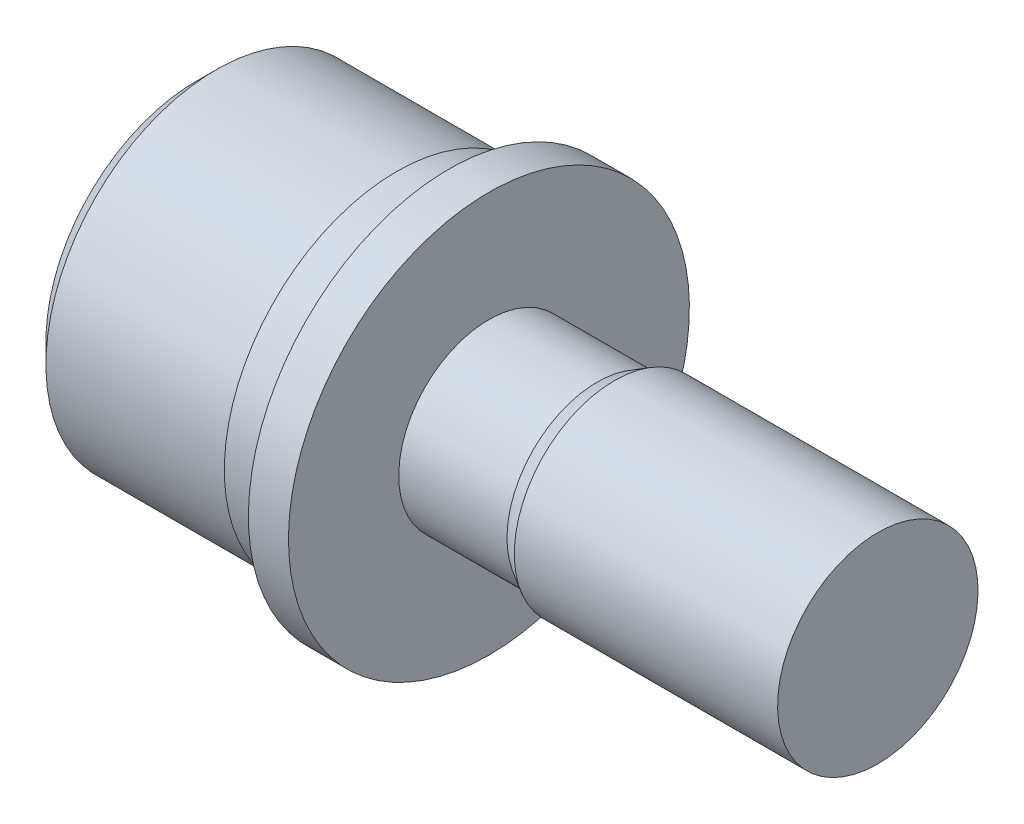
ISO-10303-21;
HEADER;
FILE_DESCRIPTION(('STEP AP214'),'2;1');
FILE_NAME('part.step','',(''),(''),'','','');
FILE_SCHEMA(('AUTOMOTIVE_DESIGN { 1 0 10303 214 1 1 1 1 }'));
ENDSEC;
DATA;
#1=APPLICATION_CONTEXT('core data for automotive mechanical design processes');
#2=APPLICATION_PROTOCOL_DEFINITION('international standard','automotive_design',2000,#1);
#3=PRODUCT_CONTEXT('',#1,'mechanical');
#4=PRODUCT('Part','Part','',(#3));
#5=PRODUCT_RELATED_PRODUCT_CATEGORY('part','',(#4));
#6=PRODUCT_DEFINITION_FORMATION('','',#4);
#7=PRODUCT_DEFINITION_CONTEXT('part definition',#1,'design');
#8=PRODUCT_DEFINITION('design','',#6,#7);
#9=PRODUCT_DEFINITION_SHAPE('','',#8);
#10=(LENGTH_UNIT() NAMED_UNIT(*) SI_UNIT(.MILLI.,.METRE.));
#11=(NAMED_UNIT(*) PLANE_ANGLE_UNIT() SI_UNIT($,.RADIAN.));
#12=(NAMED_UNIT(*) SI_UNIT($,.STERADIAN.) SOLID_ANGLE_UNIT());
#13=UNCERTAINTY_MEASURE_WITH_UNIT(LENGTH_MEASURE(1.E-05),#10,'distance_accuracy_value','');
#14=(GEOMETRIC_REPRESENTATION_CONTEXT(3) GLOBAL_UNCERTAINTY_ASSIGNED_CONTEXT((#13)) GLOBAL_UNIT_ASSIGNED_CONTEXT((#10,
#11,#12)) REPRESENTATION_CONTEXT('',''));
#15=CARTESIAN_POINT('',(0.,0.,0.));
#16=DIRECTION('',(0.,0.,1.));
#17=DIRECTION('',(1.,0.,0.));
#18=AXIS2_PLACEMENT_3D('',#15,#16,#17);
#19=CARTESIAN_POINT('',(-4.8,0.,0.));
#20=DIRECTION('',(-1.,0.,0.));
#21=DIRECTION('',(0.,0.,1.));
#22=AXIS2_PLACEMENT_3D('',#19,#20,#21);
#23=PLANE('',#22);
#24=DIRECTION('',(0.,-0.5,-0.866025403784439));
#25=VECTOR('',#24,1.);
#26=CARTESIAN_POINT('',(-4.8,1.73205080756888,-0.999999999999999));
#27=LINE('',#26,#25);
#28=CARTESIAN_POINT('',(-4.79999999999996,1.73205080756897,-1.00000000000005));
#29=VERTEX_POINT('',#28);
#30=CARTESIAN_POINT('',(-4.8,1.15470053837925,-2.));
#31=VERTEX_POINT('',#30);
#32=EDGE_CURVE('E90',#29,#31,#27,.T.);
#33=ORIENTED_EDGE('',*,*,#32,.T.);
#34=DIRECTION('',(0.,1.,0.));
#35=VECTOR('',#34,1.);
#36=CARTESIAN_POINT('',(-4.8,0.,-2.));
#37=LINE('',#36,#35);
#38=CARTESIAN_POINT('',(-4.79999999999996,0.,-2.00000000000011));
#39=VERTEX_POINT('',#38);
#40=EDGE_CURVE('E87',#31,#39,#37,.F.);
#41=ORIENTED_EDGE('',*,*,#40,.T.);
#42=CARTESIAN_POINT('',(-4.79999999999992,0.,0.));
#43=DIRECTION('',(-1.,0.,0.));
#44=DIRECTION('',(0.,0.,1.));
#45=AXIS2_PLACEMENT_3D('',#42,#43,#44);
#46=CIRCLE('',#45,2.00000000000022);
#47=EDGE_CURVE('E18',#39,#29,#46,.F.);
#48=ORIENTED_EDGE('',*,*,#47,.T.);
#49=EDGE_LOOP('',(#33,#41,#48));
#50=FACE_BOUND('',#49,.T.);
#51=ADVANCED_FACE('F15',(#50),#23,.T.);
#52=CARTESIAN_POINT('',(-4.8,0.,0.));
#53=DIRECTION('',(-1.,0.,0.));
#54=DIRECTION('',(0.,0.,1.));
#55=AXIS2_PLACEMENT_3D('',#52,#53,#54);
#56=PLANE('',#55);
#57=DIRECTION('',(0.,0.499999999999998,-0.86602540378444));
#58=VECTOR('',#57,1.);
#59=CARTESIAN_POINT('',(-4.8,1.73205080756888,0.999999999999999));
#60=LINE('',#59,#58);
#61=CARTESIAN_POINT('',(-4.79999999999996,1.73205080756897,1.00000000000006));
#62=VERTEX_POINT('',#61);
#63=CARTESIAN_POINT('',(-4.8,2.3094010767585,0.));
#64=VERTEX_POINT('',#63);
#65=EDGE_CURVE('E95',#62,#64,#60,.T.);
#66=ORIENTED_EDGE('',*,*,#65,.T.);
#67=DIRECTION('',(0.,-0.499999999999999,-0.866025403784439));
#68=VECTOR('',#67,1.);
#69=CARTESIAN_POINT('',(-4.8,2.3094010767585,0.));
#70=LINE('',#69,#68);
#71=EDGE_CURVE('E137',#64,#29,#70,.T.);
#72=ORIENTED_EDGE('',*,*,#71,.T.);
#73=CARTESIAN_POINT('',(-4.79999999999992,0.,0.));
#74=DIRECTION('',(-1.,0.,0.));
#75=DIRECTION('',(0.,0.,1.));
#76=AXIS2_PLACEMENT_3D('',#73,#74,#75);
#77=CIRCLE('',#76,2.00000000000022);
#78=EDGE_CURVE('E106',#29,#62,#77,.F.);
#79=ORIENTED_EDGE('',*,*,#78,.T.);
#80=EDGE_LOOP('',(#66,#72,#79));
#81=FACE_BOUND('',#80,.T.);
#82=ADVANCED_FACE('F186',(#81),#56,.T.);
#83=CARTESIAN_POINT('',(-4.8,0.,0.));
#84=DIRECTION('',(-1.,0.,0.));
#85=DIRECTION('',(0.,0.,1.));
#86=AXIS2_PLACEMENT_3D('',#83,#84,#85);
#87=PLANE('',#86);
#88=DIRECTION('',(0.,1.,0.));
#89=VECTOR('',#88,1.);
#90=CARTESIAN_POINT('',(-4.8,0.,2.));
#91=LINE('',#90,#89);
#92=CARTESIAN_POINT('',(-4.79999999999996,0.,2.00000000000011));
#93=VERTEX_POINT('',#92);
#94=CARTESIAN_POINT('',(-4.8,1.15470053837925,2.));
#95=VERTEX_POINT('',#94);
#96=EDGE_CURVE('E135',#93,#95,#91,.T.);
#97=ORIENTED_EDGE('',*,*,#96,.T.);
#98=DIRECTION('',(0.,0.500000000000001,-0.866025403784438));
#99=VECTOR('',#98,1.);
#100=CARTESIAN_POINT('',(-4.8,1.15470053837925,2.));
#101=LINE('',#100,#99);
#102=EDGE_CURVE('E133',#95,#62,#101,.T.);
#103=ORIENTED_EDGE('',*,*,#102,.T.);
#104=CARTESIAN_POINT('',(-4.79999999999992,0.,0.));
#105=DIRECTION('',(-1.,0.,0.));
#106=DIRECTION('',(0.,0.,1.));
#107=AXIS2_PLACEMENT_3D('',#104,#105,#106);
#108=CIRCLE('',#107,2.00000000000022);
#109=EDGE_CURVE('E183',#62,#93,#108,.F.);
#110=ORIENTED_EDGE('',*,*,#109,.T.);
#111=EDGE_LOOP('',(#97,#103,#110));
#112=FACE_BOUND('',#111,.T.);
#113=ADVANCED_FACE('F427',(#112),#87,.T.);
#114=CARTESIAN_POINT('',(-4.8,0.,0.));
#115=DIRECTION('',(-1.,0.,0.));
#116=DIRECTION('',(0.,0.,1.));
#117=AXIS2_PLACEMENT_3D('',#114,#115,#116);
#118=PLANE('',#117);
#119=DIRECTION('',(0.,0.499999999999999,0.866025403784439));
#120=VECTOR('',#119,1.);
#121=CARTESIAN_POINT('',(-4.8,-1.73205080756888,0.999999999999999));
#122=LINE('',#121,#120);
#123=CARTESIAN_POINT('',(-4.79999999999996,-1.73205080756897,1.00000000000006));
#124=VERTEX_POINT('',#123);
#125=CARTESIAN_POINT('',(-4.8,-1.15470053837925,2.));
#126=VERTEX_POINT('',#125);
#127=EDGE_CURVE('E131',#124,#126,#122,.T.);
#128=ORIENTED_EDGE('',*,*,#127,.T.);
#129=DIRECTION('',(0.,1.,0.));
#130=VECTOR('',#129,1.);
#131=CARTESIAN_POINT('',(-4.8,0.,2.));
#132=LINE('',#131,#130);
#133=EDGE_CURVE('E129',#126,#93,#132,.T.);
#134=ORIENTED_EDGE('',*,*,#133,.T.);
#135=CARTESIAN_POINT('',(-4.79999999999992,0.,0.));
#136=DIRECTION('',(-1.,0.,0.));
#137=DIRECTION('',(0.,0.,1.));
#138=AXIS2_PLACEMENT_3D('',#135,#136,#137);
#139=CIRCLE('',#138,2.00000000000022);
#140=EDGE_CURVE('E180',#93,#124,#139,.F.);
#141=ORIENTED_EDGE('',*,*,#140,.T.);
#142=EDGE_LOOP('',(#128,#134,#141));
#143=FACE_BOUND('',#142,.T.);
#144=ADVANCED_FACE('F417',(#143),#118,.T.);
#145=CARTESIAN_POINT('',(-4.8,0.,0.));
#146=DIRECTION('',(-1.,0.,0.));
#147=DIRECTION('',(0.,0.,1.));
#148=AXIS2_PLACEMENT_3D('',#145,#146,#147);
#149=PLANE('',#148);
#150=DIRECTION('',(0.,-0.5,0.866025403784438));
#151=VECTOR('',#150,1.);
#152=CARTESIAN_POINT('',(-4.8,-1.73205080756888,-1.));
#153=LINE('',#152,#151);
#154=CARTESIAN_POINT('',(-4.79999999999996,-1.73205080756897,-1.00000000000006));
#155=VERTEX_POINT('',#154);
#156=CARTESIAN_POINT('',(-4.8,-2.3094010767585,0.));
#157=VERTEX_POINT('',#156);
#158=EDGE_CURVE('E127',#155,#157,#153,.T.);
#159=ORIENTED_EDGE('',*,*,#158,.T.);
#160=DIRECTION('',(0.,0.500000000000001,0.866025403784438));
#161=VECTOR('',#160,1.);
#162=CARTESIAN_POINT('',(-4.8,-2.3094010767585,0.));
#163=LINE('',#162,#161);
#164=EDGE_CURVE('E107',#157,#124,#163,.T.);
#165=ORIENTED_EDGE('',*,*,#164,.T.);
#166=CARTESIAN_POINT('',(-4.79999999999992,0.,0.));
#167=DIRECTION('',(-1.,0.,0.));
#168=DIRECTION('',(0.,0.,1.));
#169=AXIS2_PLACEMENT_3D('',#166,#167,#168);
#170=CIRCLE('',#169,2.00000000000022);
#171=EDGE_CURVE('E115',#124,#155,#170,.F.);
#172=ORIENTED_EDGE('',*,*,#171,.T.);
#173=EDGE_LOOP('',(#159,#165,#172));
#174=FACE_BOUND('',#173,.T.);
#175=ADVANCED_FACE('F407',(#174),#149,.T.);
#176=CARTESIAN_POINT('',(-4.79999999999992,0.,0.));
#177=DIRECTION('',(-1.,0.,0.));
#178=DIRECTION('',(0.,0.,1.));
#179=AXIS2_PLACEMENT_3D('',#176,#177,#178);
#180=CONICAL_SURFACE('',#179,2.00000000000022,1.04719755119659);
#181=CARTESIAN_POINT('',(-3.64529946162073,0.,-2.22044604925031E-13));
#182=VERTEX_POINT('',#181);
#183=VERTEX_LOOP('',#182);
#184=FACE_BOUND('',#183,.T.);
#185=ORIENTED_EDGE('',*,*,#47,.F.);
#186=CARTESIAN_POINT('',(-4.79999999999992,0.,0.));
#187=DIRECTION('',(-1.,0.,0.));
#188=DIRECTION('',(0.,0.,1.));
#189=AXIS2_PLACEMENT_3D('',#186,#187,#188);
#190=CIRCLE('',#189,2.00000000000022);
#191=EDGE_CURVE('E103',#155,#39,#190,.F.);
#192=ORIENTED_EDGE('',*,*,#191,.F.);
#193=ORIENTED_EDGE('',*,*,#171,.F.);
#194=ORIENTED_EDGE('',*,*,#140,.F.);
#195=ORIENTED_EDGE('',*,*,#109,.F.);
#196=ORIENTED_EDGE('',*,*,#78,.F.);
#197=EDGE_LOOP('',(#185,#192,#193,#194,#195,#196));
#198=FACE_BOUND('',#197,.T.);
#199=ADVANCED_FACE('F101',(#184,#198),#180,.F.);
#200=CARTESIAN_POINT('',(-4.8,0.,0.));
#201=DIRECTION('',(-1.,0.,0.));
#202=DIRECTION('',(0.,0.,1.));
#203=AXIS2_PLACEMENT_3D('',#200,#201,#202);
#204=PLANE('',#203);
#205=DIRECTION('',(0.,1.,0.));
#206=VECTOR('',#205,1.);
#207=CARTESIAN_POINT('',(-4.8,1.15470053837925,-2.));
#208=LINE('',#207,#206);
#209=CARTESIAN_POINT('',(-4.8,-1.15470053837925,-2.));
#210=VERTEX_POINT('',#209);
#211=EDGE_CURVE('E112',#39,#210,#208,.F.);
#212=ORIENTED_EDGE('',*,*,#211,.T.);
#213=DIRECTION('',(0.,-0.5,0.866025403784439));
#214=VECTOR('',#213,1.);
#215=CARTESIAN_POINT('',(-4.8,-1.15470053837925,-2.));
#216=LINE('',#215,#214);
#217=EDGE_CURVE('E114',#210,#155,#216,.T.);
#218=ORIENTED_EDGE('',*,*,#217,.T.);
#219=ORIENTED_EDGE('',*,*,#191,.T.);
#220=EDGE_LOOP('',(#212,#218,#219));
#221=FACE_BOUND('',#220,.T.);
#222=ADVANCED_FACE('F111',(#221),#204,.T.);
#223=CARTESIAN_POINT('',(-4.8,1.15470053837925,-2.));
#224=DIRECTION('',(0.,0.,-1.));
#225=DIRECTION('',(0.,1.,0.));
#226=AXIS2_PLACEMENT_3D('',#223,#224,#225);
#227=PLANE('',#226);
#228=DIRECTION('',(1.,0.,0.));
#229=VECTOR('',#228,1.);
#230=CARTESIAN_POINT('',(-4.8,-1.15470053837925,-2.));
#231=LINE('',#230,#229);
#232=CARTESIAN_POINT('',(-7.3,-1.15470053837925,-2.));
#233=VERTEX_POINT('',#232);
#234=EDGE_CURVE('E119',#233,#210,#231,.T.);
#235=ORIENTED_EDGE('',*,*,#234,.T.);
#236=ORIENTED_EDGE('',*,*,#211,.F.);
#237=ORIENTED_EDGE('',*,*,#40,.F.);
#238=DIRECTION('',(1.,0.,0.));
#239=VECTOR('',#238,1.);
#240=CARTESIAN_POINT('',(-4.8,1.15470053837925,-2.));
#241=LINE('',#240,#239);
#242=CARTESIAN_POINT('',(-7.3,1.15470053837925,-2.));
#243=VERTEX_POINT('',#242);
#244=EDGE_CURVE('E151',#31,#243,#241,.F.);
#245=ORIENTED_EDGE('',*,*,#244,.T.);
#246=DIRECTION('',(0.,1.,0.));
#247=VECTOR('',#246,1.);
#248=CARTESIAN_POINT('',(-7.3,4.25,-2.));
#249=LINE('',#248,#247);
#250=EDGE_CURVE('E152',#243,#233,#249,.F.);
#251=ORIENTED_EDGE('',*,*,#250,.T.);
#252=EDGE_LOOP('',(#235,#236,#237,#245,#251));
#253=FACE_BOUND('',#252,.T.);
#254=ADVANCED_FACE('F117',(#253),#227,.F.);
#255=CARTESIAN_POINT('',(-4.8,-1.15470053837925,-2.));
#256=DIRECTION('',(0.,-0.866025403784439,-0.5));
#257=DIRECTION('',(0.,0.5,-0.866025403784439));
#258=AXIS2_PLACEMENT_3D('',#255,#256,#257);
#259=PLANE('',#258);
#260=DIRECTION('',(1.,0.,0.));
#261=VECTOR('',#260,1.);
#262=CARTESIAN_POINT('',(-4.8,-2.3094010767585,0.));
#263=LINE('',#262,#261);
#264=CARTESIAN_POINT('',(-7.3,-2.3094010767585,0.));
#265=VERTEX_POINT('',#264);
#266=EDGE_CURVE('E121',#265,#157,#263,.T.);
#267=ORIENTED_EDGE('',*,*,#266,.T.);
#268=ORIENTED_EDGE('',*,*,#158,.F.);
#269=ORIENTED_EDGE('',*,*,#217,.F.);
#270=ORIENTED_EDGE('',*,*,#234,.F.);
#271=DIRECTION('',(0.,-0.5,0.866025403784439));
#272=VECTOR('',#271,1.);
#273=CARTESIAN_POINT('',(-7.3,-1.15470053837925,-2.));
#274=LINE('',#273,#272);
#275=EDGE_CURVE('E191',#233,#265,#274,.T.);
#276=ORIENTED_EDGE('',*,*,#275,.T.);
#277=EDGE_LOOP('',(#267,#268,#269,#270,#276));
#278=FACE_BOUND('',#277,.T.);
#279=ADVANCED_FACE('F372',(#278),#259,.F.);
#280=CARTESIAN_POINT('',(-4.8,-2.3094010767585,0.));
#281=DIRECTION('',(0.,-0.866025403784439,0.5));
#282=DIRECTION('',(0.,-0.5,-0.866025403784439));
#283=AXIS2_PLACEMENT_3D('',#280,#281,#282);
#284=PLANE('',#283);
#285=DIRECTION('',(1.,0.,0.));
#286=VECTOR('',#285,1.);
#287=CARTESIAN_POINT('',(-4.8,-1.15470053837925,2.));
#288=LINE('',#287,#286);
#289=CARTESIAN_POINT('',(-7.3,-1.15470053837925,2.));
#290=VERTEX_POINT('',#289);
#291=EDGE_CURVE('E144',#290,#126,#288,.T.);
#292=ORIENTED_EDGE('',*,*,#291,.T.);
#293=ORIENTED_EDGE('',*,*,#127,.F.);
#294=ORIENTED_EDGE('',*,*,#164,.F.);
#295=ORIENTED_EDGE('',*,*,#266,.F.);
#296=DIRECTION('',(0.,0.5,0.866025403784439));
#297=VECTOR('',#296,1.);
#298=CARTESIAN_POINT('',(-7.3,-2.3094010767585,0.));
#299=LINE('',#298,#297);
#300=EDGE_CURVE('E193',#265,#290,#299,.T.);
#301=ORIENTED_EDGE('',*,*,#300,.T.);
#302=EDGE_LOOP('',(#292,#293,#294,#295,#301));
#303=FACE_BOUND('',#302,.T.);
#304=ADVANCED_FACE('F362',(#303),#284,.F.);
#305=CARTESIAN_POINT('',(-4.8,-1.15470053837925,2.));
#306=DIRECTION('',(0.,0.,1.));
#307=DIRECTION('',(0.,-1.,0.));
#308=AXIS2_PLACEMENT_3D('',#305,#306,#307);
#309=PLANE('',#308);
#310=DIRECTION('',(1.,0.,0.));
#311=VECTOR('',#310,1.);
#312=CARTESIAN_POINT('',(-4.8,1.15470053837925,2.));
#313=LINE('',#312,#311);
#314=CARTESIAN_POINT('',(-7.3,1.15470053837925,2.));
#315=VERTEX_POINT('',#314);
#316=EDGE_CURVE('E147',#315,#95,#313,.T.);
#317=ORIENTED_EDGE('',*,*,#316,.T.);
#318=ORIENTED_EDGE('',*,*,#96,.F.);
#319=ORIENTED_EDGE('',*,*,#133,.F.);
#320=ORIENTED_EDGE('',*,*,#291,.F.);
#321=DIRECTION('',(0.,1.,0.));
#322=VECTOR('',#321,1.);
#323=CARTESIAN_POINT('',(-7.3,4.25,2.));
#324=LINE('',#323,#322);
#325=EDGE_CURVE('E198',#290,#315,#324,.T.);
#326=ORIENTED_EDGE('',*,*,#325,.T.);
#327=EDGE_LOOP('',(#317,#318,#319,#320,#326));
#328=FACE_BOUND('',#327,.T.);
#329=ADVANCED_FACE('F352',(#328),#309,.F.);
#330=CARTESIAN_POINT('',(-4.8,1.15470053837925,2.));
#331=DIRECTION('',(0.,0.866025403784439,0.5));
#332=DIRECTION('',(0.,-0.5,0.866025403784439));
#333=AXIS2_PLACEMENT_3D('',#330,#331,#332);
#334=PLANE('',#333);
#335=DIRECTION('',(1.,0.,0.));
#336=VECTOR('',#335,1.);
#337=CARTESIAN_POINT('',(-4.8,2.3094010767585,0.));
#338=LINE('',#337,#336);
#339=CARTESIAN_POINT('',(-7.3,2.3094010767585,0.));
#340=VERTEX_POINT('',#339);
#341=EDGE_CURVE('E33',#340,#64,#338,.T.);
#342=ORIENTED_EDGE('',*,*,#341,.T.);
#343=ORIENTED_EDGE('',*,*,#65,.F.);
#344=ORIENTED_EDGE('',*,*,#102,.F.);
#345=ORIENTED_EDGE('',*,*,#316,.F.);
#346=DIRECTION('',(0.,0.5,-0.866025403784439));
#347=VECTOR('',#346,1.);
#348=CARTESIAN_POINT('',(-7.3,1.15470053837925,2.));
#349=LINE('',#348,#347);
#350=EDGE_CURVE('E201',#315,#340,#349,.T.);
#351=ORIENTED_EDGE('',*,*,#350,.T.);
#352=EDGE_LOOP('',(#342,#343,#344,#345,#351));
#353=FACE_BOUND('',#352,.T.);
#354=ADVANCED_FACE('F343',(#353),#334,.F.);
#355=CARTESIAN_POINT('',(-4.8,2.3094010767585,0.));
#356=DIRECTION('',(0.,0.866025403784439,-0.5));
#357=DIRECTION('',(0.,0.5,0.866025403784439));
#358=AXIS2_PLACEMENT_3D('',#355,#356,#357);
#359=PLANE('',#358);
#360=ORIENTED_EDGE('',*,*,#244,.F.);
#361=ORIENTED_EDGE('',*,*,#32,.F.);
#362=ORIENTED_EDGE('',*,*,#71,.F.);
#363=ORIENTED_EDGE('',*,*,#341,.F.);
#364=DIRECTION('',(0.,-0.5,-0.866025403784439));
#365=VECTOR('',#364,1.);
#366=CARTESIAN_POINT('',(-7.3,2.3094010767585,0.));
#367=LINE('',#366,#365);
#368=EDGE_CURVE('E176',#340,#243,#367,.T.);
#369=ORIENTED_EDGE('',*,*,#368,.T.);
#370=EDGE_LOOP('',(#360,#361,#362,#363,#369));
#371=FACE_BOUND('',#370,.T.);
#372=ADVANCED_FACE('F188',(#371),#359,.F.);
#373=CARTESIAN_POINT('',(-7.3,4.25,0.));
#374=DIRECTION('',(1.,0.,0.));
#375=DIRECTION('',(0.,1.,0.));
#376=AXIS2_PLACEMENT_3D('',#373,#374,#375);
#377=PLANE('',#376);
#378=ORIENTED_EDGE('',*,*,#350,.F.);
#379=ORIENTED_EDGE('',*,*,#325,.F.);
#380=ORIENTED_EDGE('',*,*,#300,.F.);
#381=ORIENTED_EDGE('',*,*,#275,.F.);
#382=ORIENTED_EDGE('',*,*,#250,.F.);
#383=ORIENTED_EDGE('',*,*,#368,.F.);
#384=EDGE_LOOP('',(#378,#379,#380,#381,#382,#383));
#385=FACE_BOUND('',#384,.T.);
#386=CARTESIAN_POINT('',(-7.29999999998654,0.,0.));
#387=DIRECTION('',(1.,0.,0.));
#388=DIRECTION('',(0.,0.,-1.));
#389=AXIS2_PLACEMENT_3D('',#386,#387,#388);
#390=CIRCLE('',#389,3.75000000002501);
#391=CARTESIAN_POINT('',(-7.29999999998654,0.,-3.75000000002501));
#392=VERTEX_POINT('',#391);
#393=EDGE_CURVE('E174',#392,#392,#390,.T.);
#394=ORIENTED_EDGE('',*,*,#393,.F.);
#395=EDGE_LOOP('',(#394));
#396=FACE_BOUND('',#395,.T.);
#397=ADVANCED_FACE('F325',(#385,#396),#377,.F.);
#398=CARTESIAN_POINT('',(-6.79999999982783,0.,0.));
#399=DIRECTION('',(1.,0.,0.));
#400=DIRECTION('',(0.,0.,-1.));
#401=AXIS2_PLACEMENT_3D('',#398,#399,#400);
#402=CONICAL_SURFACE('',#401,4.25000000018372,0.785398163397448);
#403=CARTESIAN_POINT('',(-6.8,0.,0.));
#404=DIRECTION('',(-1.,0.,0.));
#405=DIRECTION('',(0.,-1.,0.));
#406=AXIS2_PLACEMENT_3D('',#403,#404,#405);
#407=CIRCLE('',#406,4.25);
#408=CARTESIAN_POINT('',(-6.8,-4.25,0.));
#409=VERTEX_POINT('',#408);
#410=EDGE_CURVE('E173',#409,#409,#407,.F.);
#411=ORIENTED_EDGE('',*,*,#410,.F.);
#412=EDGE_LOOP('',(#411));
#413=FACE_BOUND('',#412,.T.);
#414=ORIENTED_EDGE('',*,*,#393,.T.);
#415=EDGE_LOOP('',(#414));
#416=FACE_BOUND('',#415,.T.);
#417=ADVANCED_FACE('F315',(#413,#416),#402,.T.);
#418=CARTESIAN_POINT('',(-7.3,0.,0.));
#419=DIRECTION('',(-1.,0.,0.));
#420=DIRECTION('',(0.,-1.,0.));
#421=AXIS2_PLACEMENT_3D('',#418,#419,#420);
#422=CYLINDRICAL_SURFACE('',#421,4.25);
#423=ORIENTED_EDGE('',*,*,#410,.T.);
#424=EDGE_LOOP('',(#423));
#425=FACE_BOUND('',#424,.T.);
#426=CARTESIAN_POINT('',(-2.3,0.,0.));
#427=DIRECTION('',(-1.,0.,0.));
#428=DIRECTION('',(0.,-1.,0.));
#429=AXIS2_PLACEMENT_3D('',#426,#427,#428);
#430=CIRCLE('',#429,4.25);
#431=CARTESIAN_POINT('',(-2.3,-4.25,0.));
#432=VERTEX_POINT('',#431);
#433=EDGE_CURVE('E170',#432,#432,#430,.T.);
#434=ORIENTED_EDGE('',*,*,#433,.T.);
#435=EDGE_LOOP('',(#434));
#436=FACE_BOUND('',#435,.T.);
#437=ADVANCED_FACE('F305',(#425,#436),#422,.T.);
#438=CARTESIAN_POINT('',(-2.3,4.3,0.));
#439=DIRECTION('',(1.,0.,0.));
#440=DIRECTION('',(0.,1.,0.));
#441=AXIS2_PLACEMENT_3D('',#438,#439,#440);
#442=PLANE('',#441);
#443=CARTESIAN_POINT('',(-2.3,0.,0.));
#444=DIRECTION('',(-1.,0.,0.));
#445=DIRECTION('',(0.,-1.,0.));
#446=AXIS2_PLACEMENT_3D('',#443,#444,#445);
#447=CIRCLE('',#446,4.3);
#448=CARTESIAN_POINT('',(-2.3,-4.3,0.));
#449=VERTEX_POINT('',#448);
#450=EDGE_CURVE('E167',#449,#449,#447,.F.);
#451=ORIENTED_EDGE('',*,*,#450,.F.);
#452=EDGE_LOOP('',(#451));
#453=FACE_BOUND('',#452,.T.);
#454=ORIENTED_EDGE('',*,*,#433,.F.);
#455=EDGE_LOOP('',(#454));
#456=FACE_BOUND('',#455,.T.);
#457=ADVANCED_FACE('F295',(#453,#456),#442,.F.);
#458=CARTESIAN_POINT('',(9.7,2.5,0.));
#459=DIRECTION('',(-1.,0.,0.));
#460=DIRECTION('',(0.,-1.,0.));
#461=AXIS2_PLACEMENT_3D('',#458,#459,#460);
#462=PLANE('',#461);
#463=CARTESIAN_POINT('',(9.7,0.,0.));
#464=DIRECTION('',(-1.,0.,0.));
#465=DIRECTION('',(0.,-1.,0.));
#466=AXIS2_PLACEMENT_3D('',#463,#464,#465);
#467=CIRCLE('',#466,2.5);
#468=CARTESIAN_POINT('',(9.7,-2.5,0.));
#469=VERTEX_POINT('',#468);
#470=EDGE_CURVE('E164',#469,#469,#467,.T.);
#471=ORIENTED_EDGE('',*,*,#470,.F.);
#472=EDGE_LOOP('',(#471));
#473=FACE_BOUND('',#472,.T.);
#474=ADVANCED_FACE('F285',(#473),#462,.F.);
#475=CARTESIAN_POINT('',(-7.3,0.,0.));
#476=DIRECTION('',(-1.,0.,0.));
#477=DIRECTION('',(0.,-1.,0.));
#478=AXIS2_PLACEMENT_3D('',#475,#476,#477);
#479=CYLINDRICAL_SURFACE('',#478,4.3);
#480=ORIENTED_EDGE('',*,*,#450,.T.);
#481=EDGE_LOOP('',(#480));
#482=FACE_BOUND('',#481,.T.);
#483=CARTESIAN_POINT('',(-1.,0.,0.));
#484=DIRECTION('',(-1.,0.,0.));
#485=DIRECTION('',(0.,-1.,0.));
#486=AXIS2_PLACEMENT_3D('',#483,#484,#485);
#487=CIRCLE('',#486,4.3);
#488=CARTESIAN_POINT('',(-1.,-4.3,0.));
#489=VERTEX_POINT('',#488);
#490=EDGE_CURVE('E161',#489,#489,#487,.T.);
#491=ORIENTED_EDGE('',*,*,#490,.T.);
#492=EDGE_LOOP('',(#491));
#493=FACE_BOUND('',#492,.T.);
#494=ADVANCED_FACE('F274',(#482,#493),#479,.T.);
#495=CARTESIAN_POINT('',(-7.3,0.,0.));
#496=DIRECTION('',(-1.,0.,0.));
#497=DIRECTION('',(0.,-1.,0.));
#498=AXIS2_PLACEMENT_3D('',#495,#496,#497);
#499=CYLINDRICAL_SURFACE('',#498,2.5);
#500=CARTESIAN_POINT('',(3.13301270188049,0.,0.));
#501=DIRECTION('',(1.,0.,0.));
#502=DIRECTION('',(0.,1.,0.));
#503=AXIS2_PLACEMENT_3D('',#500,#501,#502);
#504=CIRCLE('',#503,2.50000000005457);
#505=CARTESIAN_POINT('',(3.13301270188049,2.50000000005457,0.));
#506=VERTEX_POINT('',#505);
#507=EDGE_CURVE('E160',#506,#506,#504,.F.);
#508=ORIENTED_EDGE('',*,*,#507,.F.);
#509=EDGE_LOOP('',(#508));
#510=FACE_BOUND('',#509,.T.);
#511=ORIENTED_EDGE('',*,*,#470,.T.);
#512=EDGE_LOOP('',(#511));
#513=FACE_BOUND('',#512,.T.);
#514=ADVANCED_FACE('F227',(#510,#513),#499,.T.);
#515=CARTESIAN_POINT('',(-1.,4.3,0.));
#516=DIRECTION('',(1.,0.,0.));
#517=DIRECTION('',(0.,1.,0.));
#518=AXIS2_PLACEMENT_3D('',#515,#516,#517);
#519=PLANE('',#518);
#520=CARTESIAN_POINT('',(-1.,0.,0.));
#521=DIRECTION('',(-1.,0.,0.));
#522=DIRECTION('',(0.,-1.,0.));
#523=AXIS2_PLACEMENT_3D('',#520,#521,#522);
#524=CIRCLE('',#523,5.);
#525=CARTESIAN_POINT('',(-1.,-5.,0.));
#526=VERTEX_POINT('',#525);
#527=EDGE_CURVE('E157',#526,#526,#524,.F.);
#528=ORIENTED_EDGE('',*,*,#527,.F.);
#529=EDGE_LOOP('',(#528));
#530=FACE_BOUND('',#529,.T.);
#531=ORIENTED_EDGE('',*,*,#490,.F.);
#532=EDGE_LOOP('',(#531));
#533=FACE_BOUND('',#532,.T.);
#534=ADVANCED_FACE('F217',(#530,#533),#519,.F.);
#535=CARTESIAN_POINT('',(3.13301270165312,0.,0.));
#536=DIRECTION('',(1.,0.,0.));
#537=DIRECTION('',(0.,0.,-1.));
#538=AXIS2_PLACEMENT_3D('',#535,#536,#537);
#539=CONICAL_SURFACE('',#538,2.49999999994088,0.523598775604156);
#540=ORIENTED_EDGE('',*,*,#507,.T.);
#541=EDGE_LOOP('',(#540));
#542=FACE_BOUND('',#541,.T.);
#543=CARTESIAN_POINT('',(2.7,0.,0.));
#544=DIRECTION('',(-1.,0.,0.));
#545=DIRECTION('',(0.,-1.,0.));
#546=AXIS2_PLACEMENT_3D('',#543,#544,#545);
#547=CIRCLE('',#546,2.25);
#548=CARTESIAN_POINT('',(2.7,-2.25,0.));
#549=VERTEX_POINT('',#548);
#550=EDGE_CURVE('E156',#549,#549,#547,.T.);
#551=ORIENTED_EDGE('',*,*,#550,.F.);
#552=EDGE_LOOP('',(#551));
#553=FACE_BOUND('',#552,.T.);
#554=ADVANCED_FACE('F214',(#542,#553),#539,.T.);
#555=CARTESIAN_POINT('',(-7.3,0.,0.));
#556=DIRECTION('',(-1.,0.,0.));
#557=DIRECTION('',(0.,-1.,0.));
#558=AXIS2_PLACEMENT_3D('',#555,#556,#557);
#559=CYLINDRICAL_SURFACE('',#558,5.);
#560=ORIENTED_EDGE('',*,*,#527,.T.);
#561=EDGE_LOOP('',(#560));
#562=FACE_BOUND('',#561,.T.);
#563=CARTESIAN_POINT('',(0.,0.,0.));
#564=DIRECTION('',(-1.,0.,0.));
#565=DIRECTION('',(0.,-1.,0.));
#566=AXIS2_PLACEMENT_3D('',#563,#564,#565);
#567=CIRCLE('',#566,5.);
#568=CARTESIAN_POINT('',(0.,-5.,0.));
#569=VERTEX_POINT('',#568);
#570=EDGE_CURVE('E24',#569,#569,#567,.T.);
#571=ORIENTED_EDGE('',*,*,#570,.T.);
#572=EDGE_LOOP('',(#571));
#573=FACE_BOUND('',#572,.T.);
#574=ADVANCED_FACE('F216',(#562,#573),#559,.T.);
#575=CARTESIAN_POINT('',(-7.3,0.,0.));
#576=DIRECTION('',(-1.,0.,0.));
#577=DIRECTION('',(0.,-1.,0.));
#578=AXIS2_PLACEMENT_3D('',#575,#576,#577);
#579=CYLINDRICAL_SURFACE('',#578,2.25);
#580=CARTESIAN_POINT('',(0.,0.,0.));
#581=DIRECTION('',(-1.,0.,0.));
#582=DIRECTION('',(0.,-1.,0.));
#583=AXIS2_PLACEMENT_3D('',#580,#581,#582);
#584=CIRCLE('',#583,2.25);
#585=CARTESIAN_POINT('',(0.,-2.25,0.));
#586=VERTEX_POINT('',#585);
#587=EDGE_CURVE('E10',#586,#586,#584,.F.);
#588=ORIENTED_EDGE('',*,*,#587,.T.);
#589=EDGE_LOOP('',(#588));
#590=FACE_BOUND('',#589,.T.);
#591=ORIENTED_EDGE('',*,*,#550,.T.);
#592=EDGE_LOOP('',(#591));
#593=FACE_BOUND('',#592,.T.);
#594=ADVANCED_FACE('F212',(#590,#593),#579,.T.);
#595=CARTESIAN_POINT('',(0.,2.25,0.));
#596=DIRECTION('',(-1.,0.,0.));
#597=DIRECTION('',(0.,-1.,0.));
#598=AXIS2_PLACEMENT_3D('',#595,#596,#597);
#599=PLANE('',#598);
#600=ORIENTED_EDGE('',*,*,#587,.F.);
#601=EDGE_LOOP('',(#600));
#602=FACE_BOUND('',#601,.T.);
#603=ORIENTED_EDGE('',*,*,#570,.F.);
#604=EDGE_LOOP('',(#603));
#605=FACE_BOUND('',#604,.T.);
#606=ADVANCED_FACE('F230',(#602,#605),#599,.F.);
#607=CLOSED_SHELL('',(#51,#82,#113,#144,#175,#199,#222,#254,#279,#304,#329,#354,#372,#397,#417,
#437,#457,#474,#494,#514,#534,#554,#574,#594,#606));
#608=MANIFOLD_SOLID_BREP('B1',#607);
#609=ADVANCED_BREP_SHAPE_REPRESENTATION('',(#18,#608),#14);
#610=SHAPE_DEFINITION_REPRESENTATION(#9,#609);
ENDSEC;
END-ISO-10303-21;
